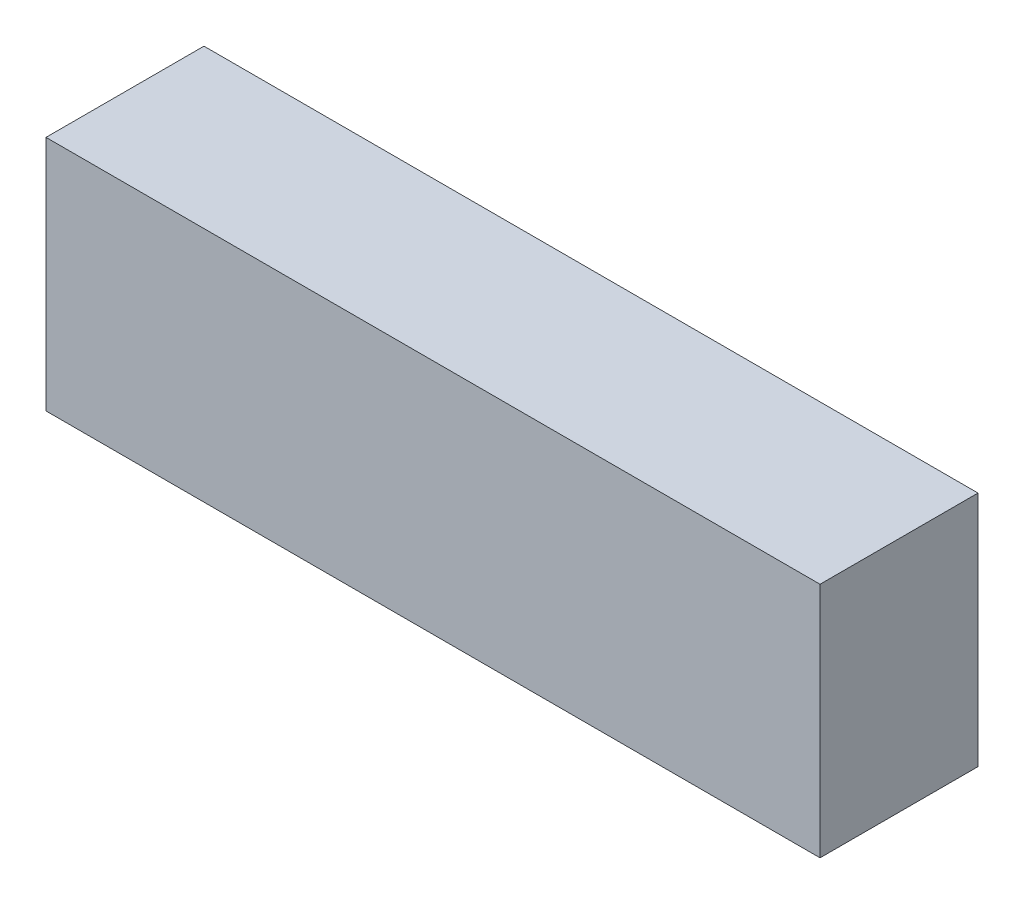
ISO-10303-21;
HEADER;
FILE_DESCRIPTION(('STEP AP214'),'2;1');
FILE_NAME('part.step','',(''),(''),'','','');
FILE_SCHEMA(('AUTOMOTIVE_DESIGN { 1 0 10303 214 1 1 1 1 }'));
ENDSEC;
DATA;
#1=APPLICATION_CONTEXT('core data for automotive mechanical design processes');
#2=APPLICATION_PROTOCOL_DEFINITION('international standard','automotive_design',2000,#1);
#3=PRODUCT_CONTEXT('',#1,'mechanical');
#4=PRODUCT('Part','Part','',(#3));
#5=PRODUCT_RELATED_PRODUCT_CATEGORY('part','',(#4));
#6=PRODUCT_DEFINITION_FORMATION('','',#4);
#7=PRODUCT_DEFINITION_CONTEXT('part definition',#1,'design');
#8=PRODUCT_DEFINITION('design','',#6,#7);
#9=PRODUCT_DEFINITION_SHAPE('','',#8);
#10=(LENGTH_UNIT() NAMED_UNIT(*) SI_UNIT(.MILLI.,.METRE.));
#11=(NAMED_UNIT(*) PLANE_ANGLE_UNIT() SI_UNIT($,.RADIAN.));
#12=(NAMED_UNIT(*) SI_UNIT($,.STERADIAN.) SOLID_ANGLE_UNIT());
#13=UNCERTAINTY_MEASURE_WITH_UNIT(LENGTH_MEASURE(1.E-05),#10,'distance_accuracy_value','');
#14=(GEOMETRIC_REPRESENTATION_CONTEXT(3) GLOBAL_UNCERTAINTY_ASSIGNED_CONTEXT((#13)) GLOBAL_UNIT_ASSIGNED_CONTEXT((#10,
#11,#12)) REPRESENTATION_CONTEXT('',''));
#15=CARTESIAN_POINT('',(0.,0.,0.));
#16=DIRECTION('',(0.,0.,1.));
#17=DIRECTION('',(1.,0.,0.));
#18=AXIS2_PLACEMENT_3D('',#15,#16,#17);
#19=CARTESIAN_POINT('',(-23.0046891878621,-9.41544117647058,10.));
#20=DIRECTION('',(1.,0.,0.));
#21=DIRECTION('',(0.,1.,0.));
#22=AXIS2_PLACEMENT_3D('',#19,#20,#21);
#23=PLANE('',#22);
#24=DIRECTION('',(0.,-1.,0.));
#25=VECTOR('',#24,1.);
#26=CARTESIAN_POINT('',(-23.0046891878621,-9.41544117647058,0.));
#27=LINE('',#26,#25);
#28=CARTESIAN_POINT('',(-23.0046891878621,5.58455882352942,0.));
#29=VERTEX_POINT('',#28);
#30=CARTESIAN_POINT('',(-23.0046891878621,-9.41544117647058,0.));
#31=VERTEX_POINT('',#30);
#32=EDGE_CURVE('E96',#29,#31,#27,.T.);
#33=ORIENTED_EDGE('',*,*,#32,.T.);
#34=DIRECTION('',(0.,0.,-1.));
#35=VECTOR('',#34,1.);
#36=CARTESIAN_POINT('',(-23.0046891878621,-9.41544117647058,10.));
#37=LINE('',#36,#35);
#38=CARTESIAN_POINT('',(-23.0046891878621,-9.41544117647058,10.));
#39=VERTEX_POINT('',#38);
#40=EDGE_CURVE('E11',#39,#31,#37,.T.);
#41=ORIENTED_EDGE('',*,*,#40,.F.);
#42=DIRECTION('',(0.,-1.,0.));
#43=VECTOR('',#42,1.);
#44=CARTESIAN_POINT('',(-23.0046891878621,-9.41544117647058,10.));
#45=LINE('',#44,#43);
#46=CARTESIAN_POINT('',(-23.0046891878621,5.58455882352942,10.));
#47=VERTEX_POINT('',#46);
#48=EDGE_CURVE('E84',#47,#39,#45,.T.);
#49=ORIENTED_EDGE('',*,*,#48,.F.);
#50=DIRECTION('',(0.,0.,-1.));
#51=VECTOR('',#50,1.);
#52=CARTESIAN_POINT('',(-23.0046891878621,5.58455882352942,10.));
#53=LINE('',#52,#51);
#54=EDGE_CURVE('E92',#47,#29,#53,.T.);
#55=ORIENTED_EDGE('',*,*,#54,.T.);
#56=EDGE_LOOP('',(#33,#41,#49,#55));
#57=FACE_BOUND('',#56,.T.);
#58=ADVANCED_FACE('F33',(#57),#23,.F.);
#59=CARTESIAN_POINT('',(-23.0046891878621,-9.41544117647058,10.));
#60=DIRECTION('',(0.,1.,0.));
#61=DIRECTION('',(0.,0.,1.));
#62=AXIS2_PLACEMENT_3D('',#59,#60,#61);
#63=PLANE('',#62);
#64=DIRECTION('',(1.,0.,0.));
#65=VECTOR('',#64,1.);
#66=CARTESIAN_POINT('',(-23.0046891878621,-9.41544117647058,0.));
#67=LINE('',#66,#65);
#68=CARTESIAN_POINT('',(25.9953108121379,-9.41544117647058,0.));
#69=VERTEX_POINT('',#68);
#70=EDGE_CURVE('E88',#31,#69,#67,.T.);
#71=ORIENTED_EDGE('',*,*,#70,.T.);
#72=DIRECTION('',(0.,0.,-1.));
#73=VECTOR('',#72,1.);
#74=CARTESIAN_POINT('',(25.9953108121379,-9.41544117647058,10.));
#75=LINE('',#74,#73);
#76=CARTESIAN_POINT('',(25.9953108121379,-9.41544117647058,10.));
#77=VERTEX_POINT('',#76);
#78=EDGE_CURVE('E41',#77,#69,#75,.T.);
#79=ORIENTED_EDGE('',*,*,#78,.F.);
#80=DIRECTION('',(1.,0.,0.));
#81=VECTOR('',#80,1.);
#82=CARTESIAN_POINT('',(-23.0046891878621,-9.41544117647058,10.));
#83=LINE('',#82,#81);
#84=EDGE_CURVE('E79',#39,#77,#83,.T.);
#85=ORIENTED_EDGE('',*,*,#84,.F.);
#86=ORIENTED_EDGE('',*,*,#40,.T.);
#87=EDGE_LOOP('',(#71,#79,#85,#86));
#88=FACE_BOUND('',#87,.T.);
#89=ADVANCED_FACE('F87',(#88),#63,.F.);
#90=CARTESIAN_POINT('',(25.9953108121379,-9.41544117647058,10.));
#91=DIRECTION('',(-1.,0.,0.));
#92=DIRECTION('',(0.,0.,1.));
#93=AXIS2_PLACEMENT_3D('',#90,#91,#92);
#94=PLANE('',#93);
#95=DIRECTION('',(0.,1.,0.));
#96=VECTOR('',#95,1.);
#97=CARTESIAN_POINT('',(25.9953108121379,-9.41544117647058,0.));
#98=LINE('',#97,#96);
#99=CARTESIAN_POINT('',(25.9953108121379,5.58455882352942,0.));
#100=VERTEX_POINT('',#99);
#101=EDGE_CURVE('E66',#69,#100,#98,.T.);
#102=ORIENTED_EDGE('',*,*,#101,.T.);
#103=DIRECTION('',(0.,0.,-1.));
#104=VECTOR('',#103,1.);
#105=CARTESIAN_POINT('',(25.9953108121379,5.58455882352942,10.));
#106=LINE('',#105,#104);
#107=CARTESIAN_POINT('',(25.9953108121379,5.58455882352942,10.));
#108=VERTEX_POINT('',#107);
#109=EDGE_CURVE('E89',#108,#100,#106,.T.);
#110=ORIENTED_EDGE('',*,*,#109,.F.);
#111=DIRECTION('',(0.,1.,0.));
#112=VECTOR('',#111,1.);
#113=CARTESIAN_POINT('',(25.9953108121379,-9.41544117647058,10.));
#114=LINE('',#113,#112);
#115=EDGE_CURVE('E82',#77,#108,#114,.T.);
#116=ORIENTED_EDGE('',*,*,#115,.F.);
#117=ORIENTED_EDGE('',*,*,#78,.T.);
#118=EDGE_LOOP('',(#102,#110,#116,#117));
#119=FACE_BOUND('',#118,.T.);
#120=ADVANCED_FACE('F90',(#119),#94,.F.);
#121=CARTESIAN_POINT('',(-23.0046891878621,5.58455882352942,10.));
#122=DIRECTION('',(0.,-1.,0.));
#123=DIRECTION('',(0.,0.,-1.));
#124=AXIS2_PLACEMENT_3D('',#121,#122,#123);
#125=PLANE('',#124);
#126=DIRECTION('',(-1.,0.,0.));
#127=VECTOR('',#126,1.);
#128=CARTESIAN_POINT('',(-23.0046891878621,5.58455882352942,0.));
#129=LINE('',#128,#127);
#130=EDGE_CURVE('E72',#100,#29,#129,.T.);
#131=ORIENTED_EDGE('',*,*,#130,.T.);
#132=ORIENTED_EDGE('',*,*,#54,.F.);
#133=DIRECTION('',(-1.,0.,0.));
#134=VECTOR('',#133,1.);
#135=CARTESIAN_POINT('',(-23.0046891878621,5.58455882352942,10.));
#136=LINE('',#135,#134);
#137=EDGE_CURVE('E49',#108,#47,#136,.T.);
#138=ORIENTED_EDGE('',*,*,#137,.F.);
#139=ORIENTED_EDGE('',*,*,#109,.T.);
#140=EDGE_LOOP('',(#131,#132,#138,#139));
#141=FACE_BOUND('',#140,.T.);
#142=ADVANCED_FACE('F103',(#141),#125,.F.);
#143=CARTESIAN_POINT('',(0.,0.,10.));
#144=DIRECTION('',(0.,0.,-1.));
#145=DIRECTION('',(-1.,0.,0.));
#146=AXIS2_PLACEMENT_3D('',#143,#144,#145);
#147=PLANE('',#146);
#148=ORIENTED_EDGE('',*,*,#48,.T.);
#149=ORIENTED_EDGE('',*,*,#84,.T.);
#150=ORIENTED_EDGE('',*,*,#115,.T.);
#151=ORIENTED_EDGE('',*,*,#137,.T.);
#152=EDGE_LOOP('',(#148,#149,#150,#151));
#153=FACE_BOUND('',#152,.T.);
#154=ADVANCED_FACE('F80',(#153),#147,.F.);
#155=CARTESIAN_POINT('',(0.,0.,0.));
#156=DIRECTION('',(0.,0.,-1.));
#157=DIRECTION('',(-1.,0.,0.));
#158=AXIS2_PLACEMENT_3D('',#155,#156,#157);
#159=PLANE('',#158);
#160=ORIENTED_EDGE('',*,*,#32,.F.);
#161=ORIENTED_EDGE('',*,*,#130,.F.);
#162=ORIENTED_EDGE('',*,*,#101,.F.);
#163=ORIENTED_EDGE('',*,*,#70,.F.);
#164=EDGE_LOOP('',(#160,#161,#162,#163));
#165=FACE_BOUND('',#164,.T.);
#166=ADVANCED_FACE('F106',(#165),#159,.T.);
#167=CLOSED_SHELL('',(#58,#89,#120,#142,#154,#166));
#168=MANIFOLD_SOLID_BREP('B2',#167);
#169=ADVANCED_BREP_SHAPE_REPRESENTATION('',(#18,#168),#14);
#170=SHAPE_DEFINITION_REPRESENTATION(#9,#169);
ENDSEC;
END-ISO-10303-21;
